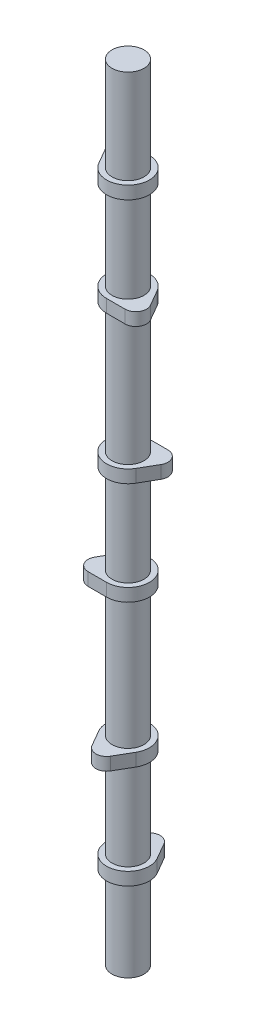
ISO-10303-21;
HEADER;
FILE_DESCRIPTION(('STEP AP214'),'2;1');
FILE_NAME('part.step','',(''),(''),'','','');
FILE_SCHEMA(('AUTOMOTIVE_DESIGN { 1 0 10303 214 1 1 1 1 }'));
ENDSEC;
DATA;
#1=APPLICATION_CONTEXT('core data for automotive mechanical design processes');
#2=APPLICATION_PROTOCOL_DEFINITION('international standard','automotive_design',2000,#1);
#3=PRODUCT_CONTEXT('',#1,'mechanical');
#4=PRODUCT('Part','Part','',(#3));
#5=PRODUCT_RELATED_PRODUCT_CATEGORY('part','',(#4));
#6=PRODUCT_DEFINITION_FORMATION('','',#4);
#7=PRODUCT_DEFINITION_CONTEXT('part definition',#1,'design');
#8=PRODUCT_DEFINITION('design','',#6,#7);
#9=PRODUCT_DEFINITION_SHAPE('','',#8);
#10=(LENGTH_UNIT() NAMED_UNIT(*) SI_UNIT(.MILLI.,.METRE.));
#11=(NAMED_UNIT(*) PLANE_ANGLE_UNIT() SI_UNIT($,.RADIAN.));
#12=(NAMED_UNIT(*) SI_UNIT($,.STERADIAN.) SOLID_ANGLE_UNIT());
#13=UNCERTAINTY_MEASURE_WITH_UNIT(LENGTH_MEASURE(1.E-05),#10,'distance_accuracy_value','');
#14=(GEOMETRIC_REPRESENTATION_CONTEXT(3) GLOBAL_UNCERTAINTY_ASSIGNED_CONTEXT((#13)) GLOBAL_UNIT_ASSIGNED_CONTEXT((#10,
#11,#12)) REPRESENTATION_CONTEXT('',''));
#15=CARTESIAN_POINT('',(0.,0.,0.));
#16=DIRECTION('',(0.,0.,1.));
#17=DIRECTION('',(1.,0.,0.));
#18=AXIS2_PLACEMENT_3D('',#15,#16,#17);
#19=CARTESIAN_POINT('',(0.,64.77,12.7));
#20=DIRECTION('',(0.,-1.,0.));
#21=DIRECTION('',(0.,0.,1.));
#22=AXIS2_PLACEMENT_3D('',#19,#20,#21);
#23=CYLINDRICAL_SURFACE('',#22,6.35);
#24=CARTESIAN_POINT('',(0.,57.15,12.7));
#25=DIRECTION('',(0.,1.,0.));
#26=DIRECTION('',(0.,0.,-1.));
#27=AXIS2_PLACEMENT_3D('',#24,#25,#26);
#28=CIRCLE('',#27,6.35);
#29=CARTESIAN_POINT('',(-5.4992613140313,57.15,15.875));
#30=VERTEX_POINT('',#29);
#31=CARTESIAN_POINT('',(5.49926131403107,57.15,15.875));
#32=VERTEX_POINT('',#31);
#33=EDGE_CURVE('E460',#30,#32,#28,.T.);
#34=ORIENTED_EDGE('',*,*,#33,.T.);
#35=DIRECTION('',(0.,-1.,0.));
#36=VECTOR('',#35,1.);
#37=CARTESIAN_POINT('',(5.49926131403107,64.77,15.875));
#38=LINE('',#37,#36);
#39=CARTESIAN_POINT('',(5.49926131403107,64.77,15.875));
#40=VERTEX_POINT('',#39);
#41=EDGE_CURVE('E490',#40,#32,#38,.T.);
#42=ORIENTED_EDGE('',*,*,#41,.F.);
#43=CARTESIAN_POINT('',(0.,64.77,12.7));
#44=DIRECTION('',(0.,1.,0.));
#45=DIRECTION('',(0.,0.,-1.));
#46=AXIS2_PLACEMENT_3D('',#43,#44,#45);
#47=CIRCLE('',#46,6.35);
#48=CARTESIAN_POINT('',(-5.4992613140313,64.77,15.875));
#49=VERTEX_POINT('',#48);
#50=EDGE_CURVE('E461',#49,#40,#47,.T.);
#51=ORIENTED_EDGE('',*,*,#50,.F.);
#52=DIRECTION('',(0.,-1.,0.));
#53=VECTOR('',#52,1.);
#54=CARTESIAN_POINT('',(-5.4992613140313,64.77,15.875));
#55=LINE('',#54,#53);
#56=EDGE_CURVE('E471',#49,#30,#55,.T.);
#57=ORIENTED_EDGE('',*,*,#56,.T.);
#58=EDGE_LOOP('',(#34,#42,#51,#57));
#59=FACE_BOUND('',#58,.T.);
#60=ADVANCED_FACE('F41',(#59),#23,.T.);
#61=CARTESIAN_POINT('',(5.49926131403107,64.77,15.875));
#62=DIRECTION('',(-0.866025403784435,0.,-0.500000000000006));
#63=DIRECTION('',(-0.500000000000006,0.,0.866025403784435));
#64=AXIS2_PLACEMENT_3D('',#61,#62,#63);
#65=PLANE('',#64);
#66=DIRECTION('',(0.500000000000006,0.,-0.866025403784435));
#67=VECTOR('',#66,1.);
#68=CARTESIAN_POINT('',(5.49926131403107,57.15,15.875));
#69=LINE('',#68,#67);
#70=CARTESIAN_POINT('',(10.9985226280623,57.15,6.35000000000008));
#71=VERTEX_POINT('',#70);
#72=EDGE_CURVE('E475',#32,#71,#69,.T.);
#73=ORIENTED_EDGE('',*,*,#72,.T.);
#74=DIRECTION('',(0.,-1.,0.));
#75=VECTOR('',#74,1.);
#76=CARTESIAN_POINT('',(10.9985226280623,64.77,6.35000000000008));
#77=LINE('',#76,#75);
#78=CARTESIAN_POINT('',(10.9985226280623,64.77,6.35000000000008));
#79=VERTEX_POINT('',#78);
#80=EDGE_CURVE('E487',#79,#71,#77,.T.);
#81=ORIENTED_EDGE('',*,*,#80,.F.);
#82=DIRECTION('',(0.500000000000006,0.,-0.866025403784435));
#83=VECTOR('',#82,1.);
#84=CARTESIAN_POINT('',(5.49926131403107,64.77,15.875));
#85=LINE('',#84,#83);
#86=EDGE_CURVE('E91',#40,#79,#85,.T.);
#87=ORIENTED_EDGE('',*,*,#86,.F.);
#88=ORIENTED_EDGE('',*,*,#41,.T.);
#89=EDGE_LOOP('',(#73,#81,#87,#88));
#90=FACE_BOUND('',#89,.T.);
#91=ADVANCED_FACE('F511',(#90),#65,.F.);
#92=CARTESIAN_POINT('',(0.,64.77,0.));
#93=DIRECTION('',(0.,-1.,0.));
#94=DIRECTION('',(0.,0.,1.));
#95=AXIS2_PLACEMENT_3D('',#92,#93,#94);
#96=CYLINDRICAL_SURFACE('',#95,12.7);
#97=CARTESIAN_POINT('',(0.,57.15,0.));
#98=DIRECTION('',(0.,1.,0.));
#99=DIRECTION('',(0.,0.,-1.));
#100=AXIS2_PLACEMENT_3D('',#97,#98,#99);
#101=CIRCLE('',#100,12.7);
#102=CARTESIAN_POINT('',(-10.9985226280624,57.15,6.34999999999992));
#103=VERTEX_POINT('',#102);
#104=EDGE_CURVE('E77',#71,#103,#101,.T.);
#105=ORIENTED_EDGE('',*,*,#104,.T.);
#106=DIRECTION('',(0.,-1.,0.));
#107=VECTOR('',#106,1.);
#108=CARTESIAN_POINT('',(-10.9985226280624,64.77,6.34999999999992));
#109=LINE('',#108,#107);
#110=CARTESIAN_POINT('',(-10.9985226280624,64.77,6.34999999999992));
#111=VERTEX_POINT('',#110);
#112=EDGE_CURVE('E484',#111,#103,#109,.T.);
#113=ORIENTED_EDGE('',*,*,#112,.F.);
#114=CARTESIAN_POINT('',(0.,64.77,0.));
#115=DIRECTION('',(0.,1.,0.));
#116=DIRECTION('',(0.,0.,-1.));
#117=AXIS2_PLACEMENT_3D('',#114,#115,#116);
#118=CIRCLE('',#117,12.7);
#119=EDGE_CURVE('E466',#79,#111,#118,.T.);
#120=ORIENTED_EDGE('',*,*,#119,.F.);
#121=ORIENTED_EDGE('',*,*,#80,.T.);
#122=EDGE_LOOP('',(#105,#113,#120,#121));
#123=FACE_BOUND('',#122,.T.);
#124=ADVANCED_FACE('F510',(#123),#96,.T.);
#125=CARTESIAN_POINT('',(-5.4992613140313,64.77,15.875));
#126=DIRECTION('',(0.866025403784442,0.,-0.499999999999994));
#127=DIRECTION('',(-0.499999999999994,0.,-0.866025403784442));
#128=AXIS2_PLACEMENT_3D('',#125,#126,#127);
#129=PLANE('',#128);
#130=DIRECTION('',(0.499999999999994,0.,0.866025403784442));
#131=VECTOR('',#130,1.);
#132=CARTESIAN_POINT('',(-5.4992613140313,57.15,15.875));
#133=LINE('',#132,#131);
#134=EDGE_CURVE('E83',#103,#30,#133,.T.);
#135=ORIENTED_EDGE('',*,*,#134,.T.);
#136=ORIENTED_EDGE('',*,*,#56,.F.);
#137=DIRECTION('',(0.499999999999994,0.,0.866025403784442));
#138=VECTOR('',#137,1.);
#139=CARTESIAN_POINT('',(-5.4992613140313,64.77,15.875));
#140=LINE('',#139,#138);
#141=EDGE_CURVE('E59',#111,#49,#140,.T.);
#142=ORIENTED_EDGE('',*,*,#141,.F.);
#143=ORIENTED_EDGE('',*,*,#112,.T.);
#144=EDGE_LOOP('',(#135,#136,#142,#143));
#145=FACE_BOUND('',#144,.T.);
#146=ADVANCED_FACE('F508',(#145),#129,.F.);
#147=CARTESIAN_POINT('',(0.,64.77,12.7));
#148=DIRECTION('',(0.,1.,0.));
#149=DIRECTION('',(0.,0.,-1.));
#150=AXIS2_PLACEMENT_3D('',#147,#148,#149);
#151=PLANE('',#150);
#152=CARTESIAN_POINT('',(0.,64.77,0.));
#153=DIRECTION('',(0.,1.,0.));
#154=DIRECTION('',(0.,0.,1.));
#155=AXIS2_PLACEMENT_3D('',#152,#153,#154);
#156=CIRCLE('',#155,9.5);
#157=CARTESIAN_POINT('',(0.,64.77,9.5));
#158=VERTEX_POINT('',#157);
#159=EDGE_CURVE('E456',#158,#158,#156,.F.);
#160=ORIENTED_EDGE('',*,*,#159,.T.);
#161=EDGE_LOOP('',(#160));
#162=FACE_BOUND('',#161,.T.);
#163=ORIENTED_EDGE('',*,*,#50,.T.);
#164=ORIENTED_EDGE('',*,*,#86,.T.);
#165=ORIENTED_EDGE('',*,*,#119,.T.);
#166=ORIENTED_EDGE('',*,*,#141,.T.);
#167=EDGE_LOOP('',(#163,#164,#165,#166));
#168=FACE_BOUND('',#167,.T.);
#169=ADVANCED_FACE('F502',(#162,#168),#151,.T.);
#170=CARTESIAN_POINT('',(0.,57.15,12.7));
#171=DIRECTION('',(0.,1.,0.));
#172=DIRECTION('',(0.,0.,-1.));
#173=AXIS2_PLACEMENT_3D('',#170,#171,#172);
#174=PLANE('',#173);
#175=CARTESIAN_POINT('',(0.,57.15,0.));
#176=DIRECTION('',(0.,1.,0.));
#177=DIRECTION('',(0.,0.,1.));
#178=AXIS2_PLACEMENT_3D('',#175,#176,#177);
#179=CIRCLE('',#178,9.5);
#180=CARTESIAN_POINT('',(0.,57.15,9.5));
#181=VERTEX_POINT('',#180);
#182=EDGE_CURVE('E51',#181,#181,#179,.F.);
#183=ORIENTED_EDGE('',*,*,#182,.F.);
#184=EDGE_LOOP('',(#183));
#185=FACE_BOUND('',#184,.T.);
#186=ORIENTED_EDGE('',*,*,#33,.F.);
#187=ORIENTED_EDGE('',*,*,#134,.F.);
#188=ORIENTED_EDGE('',*,*,#104,.F.);
#189=ORIENTED_EDGE('',*,*,#72,.F.);
#190=EDGE_LOOP('',(#186,#187,#188,#189));
#191=FACE_BOUND('',#190,.T.);
#192=ADVANCED_FACE('F499',(#185,#191),#174,.F.);
#193=CARTESIAN_POINT('',(0.,120.65,0.));
#194=DIRECTION('',(0.,-1.,0.));
#195=DIRECTION('',(0.,0.,-1.));
#196=AXIS2_PLACEMENT_3D('',#193,#194,#195);
#197=CYLINDRICAL_SURFACE('',#196,9.5);
#198=CARTESIAN_POINT('',(0.,3.80999999999999,0.));
#199=DIRECTION('',(0.,1.,0.));
#200=DIRECTION('',(0.,0.,1.));
#201=AXIS2_PLACEMENT_3D('',#198,#199,#200);
#202=CIRCLE('',#201,9.5);
#203=CARTESIAN_POINT('',(0.,3.80999999999999,9.5));
#204=VERTEX_POINT('',#203);
#205=EDGE_CURVE('E44',#204,#204,#202,.T.);
#206=ORIENTED_EDGE('',*,*,#205,.T.);
#207=EDGE_LOOP('',(#206));
#208=FACE_BOUND('',#207,.T.);
#209=ORIENTED_EDGE('',*,*,#182,.T.);
#210=EDGE_LOOP('',(#209));
#211=FACE_BOUND('',#210,.T.);
#212=ADVANCED_FACE('F497',(#208,#211),#197,.T.);
#213=ORIENTED_EDGE('',*,*,#159,.F.);
#214=EDGE_LOOP('',(#213));
#215=FACE_BOUND('',#214,.T.);
#216=CARTESIAN_POINT('',(0.,142.24,0.));
#217=DIRECTION('',(0.,1.,0.));
#218=DIRECTION('',(0.866025403784436,0.,-0.500000000000004));
#219=AXIS2_PLACEMENT_3D('',#216,#217,#218);
#220=CIRCLE('',#219,9.5);
#221=CARTESIAN_POINT('',(8.22724133595215,142.24,-4.75000000000004));
#222=VERTEX_POINT('',#221);
#223=EDGE_CURVE('E403',#222,#222,#220,.T.);
#224=ORIENTED_EDGE('',*,*,#223,.F.);
#225=EDGE_LOOP('',(#224));
#226=FACE_BOUND('',#225,.T.);
#227=ADVANCED_FACE('F524',(#215,#226),#197,.T.);
#228=CARTESIAN_POINT('',(0.,3.81,-12.7));
#229=DIRECTION('',(0.,-1.,0.));
#230=DIRECTION('',(0.,0.,-1.));
#231=AXIS2_PLACEMENT_3D('',#228,#229,#230);
#232=CYLINDRICAL_SURFACE('',#231,6.35);
#233=CARTESIAN_POINT('',(0.,-3.81,-12.7));
#234=DIRECTION('',(0.,1.,0.));
#235=DIRECTION('',(0.,0.,1.));
#236=AXIS2_PLACEMENT_3D('',#233,#234,#235);
#237=CIRCLE('',#236,6.35);
#238=CARTESIAN_POINT('',(5.49926131403118,-3.81,-15.875));
#239=VERTEX_POINT('',#238);
#240=CARTESIAN_POINT('',(-5.49926131403118,-3.81,-15.875));
#241=VERTEX_POINT('',#240);
#242=EDGE_CURVE('E414',#239,#241,#237,.T.);
#243=ORIENTED_EDGE('',*,*,#242,.T.);
#244=DIRECTION('',(0.,-1.,0.));
#245=VECTOR('',#244,1.);
#246=CARTESIAN_POINT('',(-5.49926131403118,3.81,-15.875));
#247=LINE('',#246,#245);
#248=CARTESIAN_POINT('',(-5.49926131403118,3.81,-15.875));
#249=VERTEX_POINT('',#248);
#250=EDGE_CURVE('E452',#249,#241,#247,.T.);
#251=ORIENTED_EDGE('',*,*,#250,.F.);
#252=CARTESIAN_POINT('',(0.,3.81,-12.7));
#253=DIRECTION('',(0.,1.,0.));
#254=DIRECTION('',(0.,0.,1.));
#255=AXIS2_PLACEMENT_3D('',#252,#253,#254);
#256=CIRCLE('',#255,6.35);
#257=CARTESIAN_POINT('',(5.49926131403118,3.81,-15.875));
#258=VERTEX_POINT('',#257);
#259=EDGE_CURVE('E415',#258,#249,#256,.T.);
#260=ORIENTED_EDGE('',*,*,#259,.F.);
#261=DIRECTION('',(0.,-1.,0.));
#262=VECTOR('',#261,1.);
#263=CARTESIAN_POINT('',(5.49926131403118,3.81,-15.875));
#264=LINE('',#263,#262);
#265=EDGE_CURVE('E429',#258,#239,#264,.T.);
#266=ORIENTED_EDGE('',*,*,#265,.T.);
#267=EDGE_LOOP('',(#243,#251,#260,#266));
#268=FACE_BOUND('',#267,.T.);
#269=ADVANCED_FACE('F527',(#268),#232,.T.);
#270=CARTESIAN_POINT('',(-5.49926131403118,3.81,-15.875));
#271=DIRECTION('',(0.866025403784438,0.,0.5));
#272=DIRECTION('',(0.5,0.,-0.866025403784439));
#273=AXIS2_PLACEMENT_3D('',#270,#271,#272);
#274=PLANE('',#273);
#275=DIRECTION('',(-0.5,0.,0.866025403784439));
#276=VECTOR('',#275,1.);
#277=CARTESIAN_POINT('',(-5.49926131403118,-3.81,-15.875));
#278=LINE('',#277,#276);
#279=CARTESIAN_POINT('',(-10.9985226280624,-3.81,-6.35000000000001));
#280=VERTEX_POINT('',#279);
#281=EDGE_CURVE('E433',#241,#280,#278,.T.);
#282=ORIENTED_EDGE('',*,*,#281,.T.);
#283=DIRECTION('',(0.,-1.,0.));
#284=VECTOR('',#283,1.);
#285=CARTESIAN_POINT('',(-10.9985226280624,3.81,-6.35000000000001));
#286=LINE('',#285,#284);
#287=CARTESIAN_POINT('',(-10.9985226280624,3.81,-6.35000000000001));
#288=VERTEX_POINT('',#287);
#289=EDGE_CURVE('E448',#288,#280,#286,.T.);
#290=ORIENTED_EDGE('',*,*,#289,.F.);
#291=DIRECTION('',(-0.5,0.,0.866025403784439));
#292=VECTOR('',#291,1.);
#293=CARTESIAN_POINT('',(-5.49926131403118,3.81,-15.875));
#294=LINE('',#293,#292);
#295=EDGE_CURVE('E419',#249,#288,#294,.T.);
#296=ORIENTED_EDGE('',*,*,#295,.F.);
#297=ORIENTED_EDGE('',*,*,#250,.T.);
#298=EDGE_LOOP('',(#282,#290,#296,#297));
#299=FACE_BOUND('',#298,.T.);
#300=ADVANCED_FACE('F532',(#299),#274,.F.);
#301=CARTESIAN_POINT('',(0.,3.81,0.));
#302=DIRECTION('',(0.,-1.,0.));
#303=DIRECTION('',(0.,0.,-1.));
#304=AXIS2_PLACEMENT_3D('',#301,#302,#303);
#305=CYLINDRICAL_SURFACE('',#304,12.7);
#306=CARTESIAN_POINT('',(0.,-3.81,0.));
#307=DIRECTION('',(0.,1.,0.));
#308=DIRECTION('',(0.,0.,1.));
#309=AXIS2_PLACEMENT_3D('',#306,#307,#308);
#310=CIRCLE('',#309,12.7);
#311=CARTESIAN_POINT('',(10.9985226280624,-3.81,-6.35));
#312=VERTEX_POINT('',#311);
#313=EDGE_CURVE('E436',#280,#312,#310,.T.);
#314=ORIENTED_EDGE('',*,*,#313,.T.);
#315=DIRECTION('',(0.,-1.,0.));
#316=VECTOR('',#315,1.);
#317=CARTESIAN_POINT('',(10.9985226280624,3.81,-6.35));
#318=LINE('',#317,#316);
#319=CARTESIAN_POINT('',(10.9985226280624,3.81,-6.35));
#320=VERTEX_POINT('',#319);
#321=EDGE_CURVE('E444',#320,#312,#318,.T.);
#322=ORIENTED_EDGE('',*,*,#321,.F.);
#323=CARTESIAN_POINT('',(0.,3.81,0.));
#324=DIRECTION('',(0.,1.,0.));
#325=DIRECTION('',(0.,0.,1.));
#326=AXIS2_PLACEMENT_3D('',#323,#324,#325);
#327=CIRCLE('',#326,12.7);
#328=EDGE_CURVE('E423',#288,#320,#327,.T.);
#329=ORIENTED_EDGE('',*,*,#328,.F.);
#330=ORIENTED_EDGE('',*,*,#289,.T.);
#331=EDGE_LOOP('',(#314,#322,#329,#330));
#332=FACE_BOUND('',#331,.T.);
#333=ADVANCED_FACE('F536',(#332),#305,.T.);
#334=CARTESIAN_POINT('',(5.49926131403118,3.81,-15.875));
#335=DIRECTION('',(-0.866025403784439,0.,0.5));
#336=DIRECTION('',(0.5,0.,0.866025403784439));
#337=AXIS2_PLACEMENT_3D('',#334,#335,#336);
#338=PLANE('',#337);
#339=DIRECTION('',(-0.5,0.,-0.866025403784439));
#340=VECTOR('',#339,1.);
#341=CARTESIAN_POINT('',(5.49926131403118,-3.81,-15.875));
#342=LINE('',#341,#340);
#343=EDGE_CURVE('E420',#312,#239,#342,.T.);
#344=ORIENTED_EDGE('',*,*,#343,.T.);
#345=ORIENTED_EDGE('',*,*,#265,.F.);
#346=DIRECTION('',(-0.5,0.,-0.866025403784439));
#347=VECTOR('',#346,1.);
#348=CARTESIAN_POINT('',(5.49926131403118,3.81,-15.875));
#349=LINE('',#348,#347);
#350=EDGE_CURVE('E426',#320,#258,#349,.T.);
#351=ORIENTED_EDGE('',*,*,#350,.F.);
#352=ORIENTED_EDGE('',*,*,#321,.T.);
#353=EDGE_LOOP('',(#344,#345,#351,#352));
#354=FACE_BOUND('',#353,.T.);
#355=ADVANCED_FACE('F540',(#354),#338,.F.);
#356=CARTESIAN_POINT('',(0.,3.81,-12.7));
#357=DIRECTION('',(0.,1.,0.));
#358=DIRECTION('',(0.,0.,1.));
#359=AXIS2_PLACEMENT_3D('',#356,#357,#358);
#360=PLANE('',#359);
#361=ORIENTED_EDGE('',*,*,#205,.F.);
#362=EDGE_LOOP('',(#361));
#363=FACE_BOUND('',#362,.T.);
#364=ORIENTED_EDGE('',*,*,#259,.T.);
#365=ORIENTED_EDGE('',*,*,#295,.T.);
#366=ORIENTED_EDGE('',*,*,#328,.T.);
#367=ORIENTED_EDGE('',*,*,#350,.T.);
#368=EDGE_LOOP('',(#364,#365,#366,#367));
#369=FACE_BOUND('',#368,.T.);
#370=ADVANCED_FACE('F544',(#363,#369),#360,.T.);
#371=CARTESIAN_POINT('',(0.,-3.81,-12.7));
#372=DIRECTION('',(0.,1.,0.));
#373=DIRECTION('',(0.,0.,1.));
#374=AXIS2_PLACEMENT_3D('',#371,#372,#373);
#375=PLANE('',#374);
#376=CARTESIAN_POINT('',(0.,-3.80999999999999,0.));
#377=DIRECTION('',(0.,1.,0.));
#378=DIRECTION('',(0.,0.,1.));
#379=AXIS2_PLACEMENT_3D('',#376,#377,#378);
#380=CIRCLE('',#379,9.5);
#381=CARTESIAN_POINT('',(0.,-3.80999999999999,9.5));
#382=VERTEX_POINT('',#381);
#383=EDGE_CURVE('E11',#382,#382,#380,.T.);
#384=ORIENTED_EDGE('',*,*,#383,.T.);
#385=EDGE_LOOP('',(#384));
#386=FACE_BOUND('',#385,.T.);
#387=ORIENTED_EDGE('',*,*,#242,.F.);
#388=ORIENTED_EDGE('',*,*,#343,.F.);
#389=ORIENTED_EDGE('',*,*,#313,.F.);
#390=ORIENTED_EDGE('',*,*,#281,.F.);
#391=EDGE_LOOP('',(#387,#388,#389,#390));
#392=FACE_BOUND('',#391,.T.);
#393=ADVANCED_FACE('F546',(#386,#392),#375,.F.);
#394=ORIENTED_EDGE('',*,*,#383,.F.);
#395=EDGE_LOOP('',(#394));
#396=FACE_BOUND('',#395,.T.);
#397=CARTESIAN_POINT('',(0.,-53.34,0.));
#398=DIRECTION('',(0.,-1.,0.));
#399=DIRECTION('',(0.,0.,-1.));
#400=AXIS2_PLACEMENT_3D('',#397,#398,#399);
#401=CIRCLE('',#400,9.5);
#402=CARTESIAN_POINT('',(0.,-53.34,-9.5));
#403=VERTEX_POINT('',#402);
#404=EDGE_CURVE('E407',#403,#403,#401,.T.);
#405=ORIENTED_EDGE('',*,*,#404,.F.);
#406=EDGE_LOOP('',(#405));
#407=FACE_BOUND('',#406,.T.);
#408=ADVANCED_FACE('F529',(#396,#407),#197,.T.);
#409=CARTESIAN_POINT('',(0.,-53.34,0.));
#410=DIRECTION('',(0.,-1.,0.));
#411=DIRECTION('',(0.,0.,-1.));
#412=AXIS2_PLACEMENT_3D('',#409,#410,#411);
#413=PLANE('',#412);
#414=ORIENTED_EDGE('',*,*,#404,.T.);
#415=EDGE_LOOP('',(#414));
#416=FACE_BOUND('',#415,.T.);
#417=ADVANCED_FACE('F553',(#416),#413,.T.);
#418=CARTESIAN_POINT('',(10.9985226280624,210.82,-6.34999999999997));
#419=DIRECTION('',(0.,-1.,0.));
#420=DIRECTION('',(0.86602540378444,0.,-0.499999999999998));
#421=AXIS2_PLACEMENT_3D('',#418,#419,#420);
#422=CYLINDRICAL_SURFACE('',#421,6.35);
#423=CARTESIAN_POINT('',(10.9985226280624,203.2,-6.34999999999997));
#424=DIRECTION('',(0.,1.,0.));
#425=DIRECTION('',(-0.86602540378444,0.,0.499999999999998));
#426=AXIS2_PLACEMENT_3D('',#423,#424,#425);
#427=CIRCLE('',#426,6.35);
#428=CARTESIAN_POINT('',(16.4977839420936,203.2,-3.17499999999996));
#429=VERTEX_POINT('',#428);
#430=CARTESIAN_POINT('',(10.9985226280624,203.2,-12.7));
#431=VERTEX_POINT('',#430);
#432=EDGE_CURVE('E357',#429,#431,#427,.T.);
#433=ORIENTED_EDGE('',*,*,#432,.T.);
#434=DIRECTION('',(0.,-1.,0.));
#435=VECTOR('',#434,1.);
#436=CARTESIAN_POINT('',(10.9985226280624,210.82,-12.7));
#437=LINE('',#436,#435);
#438=CARTESIAN_POINT('',(10.9985226280624,210.82,-12.7));
#439=VERTEX_POINT('',#438);
#440=EDGE_CURVE('E395',#439,#431,#437,.T.);
#441=ORIENTED_EDGE('',*,*,#440,.F.);
#442=CARTESIAN_POINT('',(10.9985226280624,210.82,-6.34999999999997));
#443=DIRECTION('',(0.,1.,0.));
#444=DIRECTION('',(-0.86602540378444,0.,0.499999999999998));
#445=AXIS2_PLACEMENT_3D('',#442,#443,#444);
#446=CIRCLE('',#445,6.35);
#447=CARTESIAN_POINT('',(16.4977839420936,210.82,-3.17499999999996));
#448=VERTEX_POINT('',#447);
#449=EDGE_CURVE('E358',#448,#439,#446,.T.);
#450=ORIENTED_EDGE('',*,*,#449,.F.);
#451=DIRECTION('',(0.,-1.,0.));
#452=VECTOR('',#451,1.);
#453=CARTESIAN_POINT('',(16.4977839420936,210.82,-3.17499999999996));
#454=LINE('',#453,#452);
#455=EDGE_CURVE('E372',#448,#429,#454,.T.);
#456=ORIENTED_EDGE('',*,*,#455,.T.);
#457=EDGE_LOOP('',(#433,#441,#450,#456));
#458=FACE_BOUND('',#457,.T.);
#459=ADVANCED_FACE('F556',(#458),#422,.T.);
#460=CARTESIAN_POINT('',(10.9985226280624,210.82,-12.7));
#461=DIRECTION('',(0.,0.,1.));
#462=DIRECTION('',(1.,0.,0.));
#463=AXIS2_PLACEMENT_3D('',#460,#461,#462);
#464=PLANE('',#463);
#465=DIRECTION('',(-1.,0.,0.));
#466=VECTOR('',#465,1.);
#467=CARTESIAN_POINT('',(10.9985226280624,203.2,-12.7));
#468=LINE('',#467,#466);
#469=CARTESIAN_POINT('',(0.,203.2,-12.7));
#470=VERTEX_POINT('',#469);
#471=EDGE_CURVE('E376',#431,#470,#468,.T.);
#472=ORIENTED_EDGE('',*,*,#471,.T.);
#473=DIRECTION('',(0.,-1.,0.));
#474=VECTOR('',#473,1.);
#475=CARTESIAN_POINT('',(0.,210.82,-12.7));
#476=LINE('',#475,#474);
#477=CARTESIAN_POINT('',(0.,210.82,-12.7));
#478=VERTEX_POINT('',#477);
#479=EDGE_CURVE('E391',#478,#470,#476,.T.);
#480=ORIENTED_EDGE('',*,*,#479,.F.);
#481=DIRECTION('',(-1.,0.,0.));
#482=VECTOR('',#481,1.);
#483=CARTESIAN_POINT('',(10.9985226280624,210.82,-12.7));
#484=LINE('',#483,#482);
#485=EDGE_CURVE('E362',#439,#478,#484,.T.);
#486=ORIENTED_EDGE('',*,*,#485,.F.);
#487=ORIENTED_EDGE('',*,*,#440,.T.);
#488=EDGE_LOOP('',(#472,#480,#486,#487));
#489=FACE_BOUND('',#488,.T.);
#490=ADVANCED_FACE('F560',(#489),#464,.F.);
#491=CARTESIAN_POINT('',(0.,210.82,0.));
#492=DIRECTION('',(0.,-1.,0.));
#493=DIRECTION('',(0.86602540378444,0.,-0.499999999999998));
#494=AXIS2_PLACEMENT_3D('',#491,#492,#493);
#495=CYLINDRICAL_SURFACE('',#494,12.7);
#496=CARTESIAN_POINT('',(0.,203.2,0.));
#497=DIRECTION('',(0.,1.,0.));
#498=DIRECTION('',(-0.86602540378444,0.,0.499999999999998));
#499=AXIS2_PLACEMENT_3D('',#496,#497,#498);
#500=CIRCLE('',#499,12.7);
#501=CARTESIAN_POINT('',(10.9985226280624,203.2,6.35000000000003));
#502=VERTEX_POINT('',#501);
#503=EDGE_CURVE('E379',#470,#502,#500,.T.);
#504=ORIENTED_EDGE('',*,*,#503,.T.);
#505=DIRECTION('',(0.,-1.,0.));
#506=VECTOR('',#505,1.);
#507=CARTESIAN_POINT('',(10.9985226280624,210.82,6.35000000000003));
#508=LINE('',#507,#506);
#509=CARTESIAN_POINT('',(10.9985226280624,210.82,6.35000000000003));
#510=VERTEX_POINT('',#509);
#511=EDGE_CURVE('E387',#510,#502,#508,.T.);
#512=ORIENTED_EDGE('',*,*,#511,.F.);
#513=CARTESIAN_POINT('',(0.,210.82,0.));
#514=DIRECTION('',(0.,1.,0.));
#515=DIRECTION('',(-0.86602540378444,0.,0.499999999999998));
#516=AXIS2_PLACEMENT_3D('',#513,#514,#515);
#517=CIRCLE('',#516,12.7);
#518=EDGE_CURVE('E366',#478,#510,#517,.T.);
#519=ORIENTED_EDGE('',*,*,#518,.F.);
#520=ORIENTED_EDGE('',*,*,#479,.T.);
#521=EDGE_LOOP('',(#504,#512,#519,#520));
#522=FACE_BOUND('',#521,.T.);
#523=ADVANCED_FACE('F564',(#522),#495,.T.);
#524=CARTESIAN_POINT('',(16.4977839420936,210.82,-3.17499999999996));
#525=DIRECTION('',(-0.866025403784437,0.,-0.500000000000002));
#526=DIRECTION('',(-0.500000000000002,0.,0.866025403784437));
#527=AXIS2_PLACEMENT_3D('',#524,#525,#526);
#528=PLANE('',#527);
#529=DIRECTION('',(0.500000000000002,0.,-0.866025403784437));
#530=VECTOR('',#529,1.);
#531=CARTESIAN_POINT('',(16.4977839420936,203.2,-3.17499999999996));
#532=LINE('',#531,#530);
#533=EDGE_CURVE('E363',#502,#429,#532,.T.);
#534=ORIENTED_EDGE('',*,*,#533,.T.);
#535=ORIENTED_EDGE('',*,*,#455,.F.);
#536=DIRECTION('',(0.500000000000002,0.,-0.866025403784437));
#537=VECTOR('',#536,1.);
#538=CARTESIAN_POINT('',(16.4977839420936,210.82,-3.17499999999996));
#539=LINE('',#538,#537);
#540=EDGE_CURVE('E369',#510,#448,#539,.T.);
#541=ORIENTED_EDGE('',*,*,#540,.F.);
#542=ORIENTED_EDGE('',*,*,#511,.T.);
#543=EDGE_LOOP('',(#534,#535,#541,#542));
#544=FACE_BOUND('',#543,.T.);
#545=ADVANCED_FACE('F568',(#544),#528,.F.);
#546=CARTESIAN_POINT('',(10.9985226280624,210.82,-6.34999999999997));
#547=DIRECTION('',(0.,1.,0.));
#548=DIRECTION('',(-0.86602540378444,0.,0.499999999999998));
#549=AXIS2_PLACEMENT_3D('',#546,#547,#548);
#550=PLANE('',#549);
#551=CARTESIAN_POINT('',(0.,210.82,0.));
#552=DIRECTION('',(0.,1.,0.));
#553=DIRECTION('',(0.866025403784436,0.,-0.500000000000004));
#554=AXIS2_PLACEMENT_3D('',#551,#552,#553);
#555=CIRCLE('',#554,9.5);
#556=CARTESIAN_POINT('',(8.22724133595215,210.82,-4.75000000000004));
#557=VERTEX_POINT('',#556);
#558=EDGE_CURVE('E353',#557,#557,#555,.F.);
#559=ORIENTED_EDGE('',*,*,#558,.T.);
#560=EDGE_LOOP('',(#559));
#561=FACE_BOUND('',#560,.T.);
#562=ORIENTED_EDGE('',*,*,#449,.T.);
#563=ORIENTED_EDGE('',*,*,#485,.T.);
#564=ORIENTED_EDGE('',*,*,#518,.T.);
#565=ORIENTED_EDGE('',*,*,#540,.T.);
#566=EDGE_LOOP('',(#562,#563,#564,#565));
#567=FACE_BOUND('',#566,.T.);
#568=ADVANCED_FACE('F572',(#561,#567),#550,.T.);
#569=CARTESIAN_POINT('',(10.9985226280624,203.2,-6.34999999999997));
#570=DIRECTION('',(0.,1.,0.));
#571=DIRECTION('',(-0.86602540378444,0.,0.499999999999998));
#572=AXIS2_PLACEMENT_3D('',#569,#570,#571);
#573=PLANE('',#572);
#574=CARTESIAN_POINT('',(0.,203.2,0.));
#575=DIRECTION('',(0.,1.,0.));
#576=DIRECTION('',(0.866025403784436,0.,-0.500000000000004));
#577=AXIS2_PLACEMENT_3D('',#574,#575,#576);
#578=CIRCLE('',#577,9.5);
#579=CARTESIAN_POINT('',(8.22724133595215,203.2,-4.75000000000004));
#580=VERTEX_POINT('',#579);
#581=EDGE_CURVE('E399',#580,#580,#578,.F.);
#582=ORIENTED_EDGE('',*,*,#581,.F.);
#583=EDGE_LOOP('',(#582));
#584=FACE_BOUND('',#583,.T.);
#585=ORIENTED_EDGE('',*,*,#432,.F.);
#586=ORIENTED_EDGE('',*,*,#533,.F.);
#587=ORIENTED_EDGE('',*,*,#503,.F.);
#588=ORIENTED_EDGE('',*,*,#471,.F.);
#589=EDGE_LOOP('',(#585,#586,#587,#588));
#590=FACE_BOUND('',#589,.T.);
#591=ADVANCED_FACE('F574',(#584,#590),#573,.F.);
#592=CARTESIAN_POINT('',(0.,266.7,0.));
#593=DIRECTION('',(0.,-1.,0.));
#594=DIRECTION('',(-0.866025403784436,0.,0.500000000000004));
#595=AXIS2_PLACEMENT_3D('',#592,#593,#594);
#596=CYLINDRICAL_SURFACE('',#595,9.5);
#597=CARTESIAN_POINT('',(0.,149.86,0.));
#598=DIRECTION('',(0.,1.,0.));
#599=DIRECTION('',(0.866025403784436,0.,-0.500000000000004));
#600=AXIS2_PLACEMENT_3D('',#597,#598,#599);
#601=CIRCLE('',#600,9.5);
#602=CARTESIAN_POINT('',(8.22724133595215,149.86,-4.75000000000004));
#603=VERTEX_POINT('',#602);
#604=EDGE_CURVE('E352',#603,#603,#601,.T.);
#605=ORIENTED_EDGE('',*,*,#604,.T.);
#606=EDGE_LOOP('',(#605));
#607=FACE_BOUND('',#606,.T.);
#608=ORIENTED_EDGE('',*,*,#581,.T.);
#609=EDGE_LOOP('',(#608));
#610=FACE_BOUND('',#609,.T.);
#611=ADVANCED_FACE('F577',(#607,#610),#596,.T.);
#612=ORIENTED_EDGE('',*,*,#558,.F.);
#613=EDGE_LOOP('',(#612));
#614=FACE_BOUND('',#613,.T.);
#615=CARTESIAN_POINT('',(0.,288.29,0.));
#616=DIRECTION('',(0.,1.,0.));
#617=DIRECTION('',(-0.866025403784443,0.,-0.499999999999992));
#618=AXIS2_PLACEMENT_3D('',#615,#616,#617);
#619=CIRCLE('',#618,9.5);
#620=CARTESIAN_POINT('',(-8.22724133595221,288.29,-4.74999999999992));
#621=VERTEX_POINT('',#620);
#622=EDGE_CURVE('E306',#621,#621,#619,.T.);
#623=ORIENTED_EDGE('',*,*,#622,.F.);
#624=EDGE_LOOP('',(#623));
#625=FACE_BOUND('',#624,.T.);
#626=ADVANCED_FACE('F582',(#614,#625),#596,.T.);
#627=CARTESIAN_POINT('',(-10.9985226280623,149.86,6.35000000000005));
#628=DIRECTION('',(0.,-1.,0.));
#629=DIRECTION('',(-0.866025403784436,0.,0.500000000000004));
#630=AXIS2_PLACEMENT_3D('',#627,#628,#629);
#631=CYLINDRICAL_SURFACE('',#630,6.35);
#632=CARTESIAN_POINT('',(-10.9985226280623,142.24,6.35000000000005));
#633=DIRECTION('',(0.,1.,0.));
#634=DIRECTION('',(0.866025403784436,0.,-0.500000000000004));
#635=AXIS2_PLACEMENT_3D('',#632,#633,#634);
#636=CIRCLE('',#635,6.35);
#637=CARTESIAN_POINT('',(-16.4977839420935,142.24,3.17500000000008));
#638=VERTEX_POINT('',#637);
#639=CARTESIAN_POINT('',(-10.9985226280623,142.24,12.7000000000001));
#640=VERTEX_POINT('',#639);
#641=EDGE_CURVE('E309',#638,#640,#636,.T.);
#642=ORIENTED_EDGE('',*,*,#641,.T.);
#643=DIRECTION('',(0.,-1.,0.));
#644=VECTOR('',#643,1.);
#645=CARTESIAN_POINT('',(-10.9985226280623,149.86,12.7000000000001));
#646=LINE('',#645,#644);
#647=CARTESIAN_POINT('',(-10.9985226280623,149.86,12.7000000000001));
#648=VERTEX_POINT('',#647);
#649=EDGE_CURVE('E348',#648,#640,#646,.T.);
#650=ORIENTED_EDGE('',*,*,#649,.F.);
#651=CARTESIAN_POINT('',(-10.9985226280623,149.86,6.35000000000005));
#652=DIRECTION('',(0.,1.,0.));
#653=DIRECTION('',(0.866025403784436,0.,-0.500000000000004));
#654=AXIS2_PLACEMENT_3D('',#651,#652,#653);
#655=CIRCLE('',#654,6.35);
#656=CARTESIAN_POINT('',(-16.4977839420935,149.86,3.17500000000008));
#657=VERTEX_POINT('',#656);
#658=EDGE_CURVE('E311',#657,#648,#655,.T.);
#659=ORIENTED_EDGE('',*,*,#658,.F.);
#660=DIRECTION('',(0.,-1.,0.));
#661=VECTOR('',#660,1.);
#662=CARTESIAN_POINT('',(-16.4977839420935,149.86,3.17500000000008));
#663=LINE('',#662,#661);
#664=EDGE_CURVE('E325',#657,#638,#663,.T.);
#665=ORIENTED_EDGE('',*,*,#664,.T.);
#666=EDGE_LOOP('',(#642,#650,#659,#665));
#667=FACE_BOUND('',#666,.T.);
#668=ADVANCED_FACE('F585',(#667),#631,.T.);
#669=CARTESIAN_POINT('',(-10.9985226280623,149.86,12.7000000000001));
#670=DIRECTION('',(0.,0.,-1.));
#671=DIRECTION('',(-1.,0.,0.));
#672=AXIS2_PLACEMENT_3D('',#669,#670,#671);
#673=PLANE('',#672);
#674=DIRECTION('',(1.,0.,0.));
#675=VECTOR('',#674,1.);
#676=CARTESIAN_POINT('',(-10.9985226280623,142.24,12.7000000000001));
#677=LINE('',#676,#675);
#678=CARTESIAN_POINT('',(0.,142.24,12.7));
#679=VERTEX_POINT('',#678);
#680=EDGE_CURVE('E329',#640,#679,#677,.T.);
#681=ORIENTED_EDGE('',*,*,#680,.T.);
#682=DIRECTION('',(0.,-1.,0.));
#683=VECTOR('',#682,1.);
#684=CARTESIAN_POINT('',(0.,149.86,12.7));
#685=LINE('',#684,#683);
#686=CARTESIAN_POINT('',(0.,149.86,12.7));
#687=VERTEX_POINT('',#686);
#688=EDGE_CURVE('E344',#687,#679,#685,.T.);
#689=ORIENTED_EDGE('',*,*,#688,.F.);
#690=DIRECTION('',(1.,0.,0.));
#691=VECTOR('',#690,1.);
#692=CARTESIAN_POINT('',(-10.9985226280623,149.86,12.7000000000001));
#693=LINE('',#692,#691);
#694=EDGE_CURVE('E315',#648,#687,#693,.T.);
#695=ORIENTED_EDGE('',*,*,#694,.F.);
#696=ORIENTED_EDGE('',*,*,#649,.T.);
#697=EDGE_LOOP('',(#681,#689,#695,#696));
#698=FACE_BOUND('',#697,.T.);
#699=ADVANCED_FACE('F589',(#698),#673,.F.);
#700=CARTESIAN_POINT('',(0.,149.86,0.));
#701=DIRECTION('',(0.,-1.,0.));
#702=DIRECTION('',(-0.866025403784436,0.,0.500000000000004));
#703=AXIS2_PLACEMENT_3D('',#700,#701,#702);
#704=CYLINDRICAL_SURFACE('',#703,12.7);
#705=CARTESIAN_POINT('',(0.,142.24,0.));
#706=DIRECTION('',(0.,1.,0.));
#707=DIRECTION('',(0.866025403784436,0.,-0.500000000000004));
#708=AXIS2_PLACEMENT_3D('',#705,#706,#707);
#709=CIRCLE('',#708,12.7);
#710=CARTESIAN_POINT('',(-10.9985226280624,142.24,-6.34999999999995));
#711=VERTEX_POINT('',#710);
#712=EDGE_CURVE('E332',#679,#711,#709,.T.);
#713=ORIENTED_EDGE('',*,*,#712,.T.);
#714=DIRECTION('',(0.,-1.,0.));
#715=VECTOR('',#714,1.);
#716=CARTESIAN_POINT('',(-10.9985226280624,149.86,-6.34999999999995));
#717=LINE('',#716,#715);
#718=CARTESIAN_POINT('',(-10.9985226280624,149.86,-6.34999999999995));
#719=VERTEX_POINT('',#718);
#720=EDGE_CURVE('E340',#719,#711,#717,.T.);
#721=ORIENTED_EDGE('',*,*,#720,.F.);
#722=CARTESIAN_POINT('',(0.,149.86,0.));
#723=DIRECTION('',(0.,1.,0.));
#724=DIRECTION('',(0.866025403784436,0.,-0.500000000000004));
#725=AXIS2_PLACEMENT_3D('',#722,#723,#724);
#726=CIRCLE('',#725,12.7);
#727=EDGE_CURVE('E319',#687,#719,#726,.T.);
#728=ORIENTED_EDGE('',*,*,#727,.F.);
#729=ORIENTED_EDGE('',*,*,#688,.T.);
#730=EDGE_LOOP('',(#713,#721,#728,#729));
#731=FACE_BOUND('',#730,.T.);
#732=ADVANCED_FACE('F593',(#731),#704,.T.);
#733=CARTESIAN_POINT('',(-16.4977839420935,149.86,3.17500000000008));
#734=DIRECTION('',(0.866025403784441,0.,0.499999999999996));
#735=DIRECTION('',(0.499999999999996,0.,-0.866025403784441));
#736=AXIS2_PLACEMENT_3D('',#733,#734,#735);
#737=PLANE('',#736);
#738=DIRECTION('',(-0.499999999999996,0.,0.866025403784441));
#739=VECTOR('',#738,1.);
#740=CARTESIAN_POINT('',(-16.4977839420935,142.24,3.17500000000008));
#741=LINE('',#740,#739);
#742=EDGE_CURVE('E316',#711,#638,#741,.T.);
#743=ORIENTED_EDGE('',*,*,#742,.T.);
#744=ORIENTED_EDGE('',*,*,#664,.F.);
#745=DIRECTION('',(-0.499999999999996,0.,0.866025403784441));
#746=VECTOR('',#745,1.);
#747=CARTESIAN_POINT('',(-16.4977839420935,149.86,3.17500000000008));
#748=LINE('',#747,#746);
#749=EDGE_CURVE('E322',#719,#657,#748,.T.);
#750=ORIENTED_EDGE('',*,*,#749,.F.);
#751=ORIENTED_EDGE('',*,*,#720,.T.);
#752=EDGE_LOOP('',(#743,#744,#750,#751));
#753=FACE_BOUND('',#752,.T.);
#754=ADVANCED_FACE('F597',(#753),#737,.F.);
#755=CARTESIAN_POINT('',(-10.9985226280623,149.86,6.35000000000005));
#756=DIRECTION('',(0.,1.,0.));
#757=DIRECTION('',(0.866025403784436,0.,-0.500000000000004));
#758=AXIS2_PLACEMENT_3D('',#755,#756,#757);
#759=PLANE('',#758);
#760=ORIENTED_EDGE('',*,*,#604,.F.);
#761=EDGE_LOOP('',(#760));
#762=FACE_BOUND('',#761,.T.);
#763=ORIENTED_EDGE('',*,*,#658,.T.);
#764=ORIENTED_EDGE('',*,*,#694,.T.);
#765=ORIENTED_EDGE('',*,*,#727,.T.);
#766=ORIENTED_EDGE('',*,*,#749,.T.);
#767=EDGE_LOOP('',(#763,#764,#765,#766));
#768=FACE_BOUND('',#767,.T.);
#769=ADVANCED_FACE('F601',(#762,#768),#759,.T.);
#770=CARTESIAN_POINT('',(-10.9985226280623,142.24,6.35000000000005));
#771=DIRECTION('',(0.,1.,0.));
#772=DIRECTION('',(0.866025403784436,0.,-0.500000000000004));
#773=AXIS2_PLACEMENT_3D('',#770,#771,#772);
#774=PLANE('',#773);
#775=ORIENTED_EDGE('',*,*,#223,.T.);
#776=EDGE_LOOP('',(#775));
#777=FACE_BOUND('',#776,.T.);
#778=ORIENTED_EDGE('',*,*,#641,.F.);
#779=ORIENTED_EDGE('',*,*,#742,.F.);
#780=ORIENTED_EDGE('',*,*,#712,.F.);
#781=ORIENTED_EDGE('',*,*,#680,.F.);
#782=EDGE_LOOP('',(#778,#779,#780,#781));
#783=FACE_BOUND('',#782,.T.);
#784=ADVANCED_FACE('F603',(#777,#783),#774,.F.);
#785=CARTESIAN_POINT('',(-10.9985226280624,356.87,-6.34999999999997));
#786=DIRECTION('',(0.,-1.,0.));
#787=DIRECTION('',(-0.86602540378444,0.,-0.499999999999998));
#788=AXIS2_PLACEMENT_3D('',#785,#786,#787);
#789=CYLINDRICAL_SURFACE('',#788,6.35);
#790=CARTESIAN_POINT('',(-10.9985226280624,349.25,-6.34999999999997));
#791=DIRECTION('',(0.,1.,0.));
#792=DIRECTION('',(0.86602540378444,0.,0.499999999999998));
#793=AXIS2_PLACEMENT_3D('',#790,#791,#792);
#794=CIRCLE('',#793,6.35);
#795=CARTESIAN_POINT('',(-10.9985226280624,349.25,-12.7));
#796=VERTEX_POINT('',#795);
#797=CARTESIAN_POINT('',(-16.4977839420936,349.25,-3.17499999999996));
#798=VERTEX_POINT('',#797);
#799=EDGE_CURVE('E260',#796,#798,#794,.T.);
#800=ORIENTED_EDGE('',*,*,#799,.T.);
#801=DIRECTION('',(0.,-1.,0.));
#802=VECTOR('',#801,1.);
#803=CARTESIAN_POINT('',(-16.4977839420936,356.87,-3.17499999999996));
#804=LINE('',#803,#802);
#805=CARTESIAN_POINT('',(-16.4977839420936,356.87,-3.17499999999996));
#806=VERTEX_POINT('',#805);
#807=EDGE_CURVE('E298',#806,#798,#804,.T.);
#808=ORIENTED_EDGE('',*,*,#807,.F.);
#809=CARTESIAN_POINT('',(-10.9985226280624,356.87,-6.34999999999997));
#810=DIRECTION('',(0.,1.,0.));
#811=DIRECTION('',(0.86602540378444,0.,0.499999999999998));
#812=AXIS2_PLACEMENT_3D('',#809,#810,#811);
#813=CIRCLE('',#812,6.35);
#814=CARTESIAN_POINT('',(-10.9985226280624,356.87,-12.7));
#815=VERTEX_POINT('',#814);
#816=EDGE_CURVE('E261',#815,#806,#813,.T.);
#817=ORIENTED_EDGE('',*,*,#816,.F.);
#818=DIRECTION('',(0.,-1.,0.));
#819=VECTOR('',#818,1.);
#820=CARTESIAN_POINT('',(-10.9985226280624,356.87,-12.7));
#821=LINE('',#820,#819);
#822=EDGE_CURVE('E275',#815,#796,#821,.T.);
#823=ORIENTED_EDGE('',*,*,#822,.T.);
#824=EDGE_LOOP('',(#800,#808,#817,#823));
#825=FACE_BOUND('',#824,.T.);
#826=ADVANCED_FACE('F606',(#825),#789,.T.);
#827=CARTESIAN_POINT('',(-16.4977839420936,356.87,-3.17499999999996));
#828=DIRECTION('',(0.866025403784437,0.,-0.500000000000002));
#829=DIRECTION('',(-0.500000000000002,0.,-0.866025403784437));
#830=AXIS2_PLACEMENT_3D('',#827,#828,#829);
#831=PLANE('',#830);
#832=DIRECTION('',(0.500000000000002,0.,0.866025403784437));
#833=VECTOR('',#832,1.);
#834=CARTESIAN_POINT('',(-16.4977839420936,349.25,-3.17499999999996));
#835=LINE('',#834,#833);
#836=CARTESIAN_POINT('',(-10.9985226280624,349.25,6.35000000000002));
#837=VERTEX_POINT('',#836);
#838=EDGE_CURVE('E279',#798,#837,#835,.T.);
#839=ORIENTED_EDGE('',*,*,#838,.T.);
#840=DIRECTION('',(0.,-1.,0.));
#841=VECTOR('',#840,1.);
#842=CARTESIAN_POINT('',(-10.9985226280624,356.87,6.35000000000002));
#843=LINE('',#842,#841);
#844=CARTESIAN_POINT('',(-10.9985226280624,356.87,6.35000000000002));
#845=VERTEX_POINT('',#844);
#846=EDGE_CURVE('E294',#845,#837,#843,.T.);
#847=ORIENTED_EDGE('',*,*,#846,.F.);
#848=DIRECTION('',(0.500000000000002,0.,0.866025403784437));
#849=VECTOR('',#848,1.);
#850=CARTESIAN_POINT('',(-16.4977839420936,356.87,-3.17499999999996));
#851=LINE('',#850,#849);
#852=EDGE_CURVE('E265',#806,#845,#851,.T.);
#853=ORIENTED_EDGE('',*,*,#852,.F.);
#854=ORIENTED_EDGE('',*,*,#807,.T.);
#855=EDGE_LOOP('',(#839,#847,#853,#854));
#856=FACE_BOUND('',#855,.T.);
#857=ADVANCED_FACE('F613',(#856),#831,.F.);
#858=CARTESIAN_POINT('',(0.,356.87,0.));
#859=DIRECTION('',(0.,-1.,0.));
#860=DIRECTION('',(-0.86602540378444,0.,-0.499999999999998));
#861=AXIS2_PLACEMENT_3D('',#858,#859,#860);
#862=CYLINDRICAL_SURFACE('',#861,12.7);
#863=CARTESIAN_POINT('',(0.,349.25,0.));
#864=DIRECTION('',(0.,1.,0.));
#865=DIRECTION('',(0.86602540378444,0.,0.499999999999998));
#866=AXIS2_PLACEMENT_3D('',#863,#864,#865);
#867=CIRCLE('',#866,12.7);
#868=CARTESIAN_POINT('',(0.,349.25,-12.7));
#869=VERTEX_POINT('',#868);
#870=EDGE_CURVE('E282',#837,#869,#867,.T.);
#871=ORIENTED_EDGE('',*,*,#870,.T.);
#872=DIRECTION('',(0.,-1.,0.));
#873=VECTOR('',#872,1.);
#874=CARTESIAN_POINT('',(0.,356.87,-12.7));
#875=LINE('',#874,#873);
#876=CARTESIAN_POINT('',(0.,356.87,-12.7));
#877=VERTEX_POINT('',#876);
#878=EDGE_CURVE('E290',#877,#869,#875,.T.);
#879=ORIENTED_EDGE('',*,*,#878,.F.);
#880=CARTESIAN_POINT('',(0.,356.87,0.));
#881=DIRECTION('',(0.,1.,0.));
#882=DIRECTION('',(0.86602540378444,0.,0.499999999999998));
#883=AXIS2_PLACEMENT_3D('',#880,#881,#882);
#884=CIRCLE('',#883,12.7);
#885=EDGE_CURVE('E269',#845,#877,#884,.T.);
#886=ORIENTED_EDGE('',*,*,#885,.F.);
#887=ORIENTED_EDGE('',*,*,#846,.T.);
#888=EDGE_LOOP('',(#871,#879,#886,#887));
#889=FACE_BOUND('',#888,.T.);
#890=ADVANCED_FACE('F617',(#889),#862,.T.);
#891=CARTESIAN_POINT('',(-10.9985226280624,356.87,-12.7));
#892=DIRECTION('',(0.,0.,1.));
#893=DIRECTION('',(1.,0.,0.));
#894=AXIS2_PLACEMENT_3D('',#891,#892,#893);
#895=PLANE('',#894);
#896=DIRECTION('',(-1.,0.,0.));
#897=VECTOR('',#896,1.);
#898=CARTESIAN_POINT('',(-10.9985226280624,349.25,-12.7));
#899=LINE('',#898,#897);
#900=EDGE_CURVE('E266',#869,#796,#899,.T.);
#901=ORIENTED_EDGE('',*,*,#900,.T.);
#902=ORIENTED_EDGE('',*,*,#822,.F.);
#903=DIRECTION('',(-1.,0.,0.));
#904=VECTOR('',#903,1.);
#905=CARTESIAN_POINT('',(-10.9985226280624,356.87,-12.7));
#906=LINE('',#905,#904);
#907=EDGE_CURVE('E272',#877,#815,#906,.T.);
#908=ORIENTED_EDGE('',*,*,#907,.F.);
#909=ORIENTED_EDGE('',*,*,#878,.T.);
#910=EDGE_LOOP('',(#901,#902,#908,#909));
#911=FACE_BOUND('',#910,.T.);
#912=ADVANCED_FACE('F621',(#911),#895,.F.);
#913=CARTESIAN_POINT('',(-10.9985226280624,356.87,-6.34999999999997));
#914=DIRECTION('',(0.,1.,0.));
#915=DIRECTION('',(0.86602540378444,0.,0.499999999999998));
#916=AXIS2_PLACEMENT_3D('',#913,#914,#915);
#917=PLANE('',#916);
#918=CARTESIAN_POINT('',(0.,356.87,0.));
#919=DIRECTION('',(0.,1.,0.));
#920=DIRECTION('',(-0.866025403784443,0.,-0.499999999999992));
#921=AXIS2_PLACEMENT_3D('',#918,#919,#920);
#922=CIRCLE('',#921,9.5);
#923=CARTESIAN_POINT('',(-8.22724133595221,356.87,-4.74999999999992));
#924=VERTEX_POINT('',#923);
#925=EDGE_CURVE('E256',#924,#924,#922,.F.);
#926=ORIENTED_EDGE('',*,*,#925,.T.);
#927=EDGE_LOOP('',(#926));
#928=FACE_BOUND('',#927,.T.);
#929=ORIENTED_EDGE('',*,*,#816,.T.);
#930=ORIENTED_EDGE('',*,*,#852,.T.);
#931=ORIENTED_EDGE('',*,*,#885,.T.);
#932=ORIENTED_EDGE('',*,*,#907,.T.);
#933=EDGE_LOOP('',(#929,#930,#931,#932));
#934=FACE_BOUND('',#933,.T.);
#935=ADVANCED_FACE('F625',(#928,#934),#917,.T.);
#936=CARTESIAN_POINT('',(-10.9985226280624,349.25,-6.34999999999997));
#937=DIRECTION('',(0.,1.,0.));
#938=DIRECTION('',(0.86602540378444,0.,0.499999999999998));
#939=AXIS2_PLACEMENT_3D('',#936,#937,#938);
#940=PLANE('',#939);
#941=CARTESIAN_POINT('',(0.,349.25,0.));
#942=DIRECTION('',(0.,1.,0.));
#943=DIRECTION('',(-0.866025403784443,0.,-0.499999999999992));
#944=AXIS2_PLACEMENT_3D('',#941,#942,#943);
#945=CIRCLE('',#944,9.5);
#946=CARTESIAN_POINT('',(-8.22724133595221,349.25,-4.74999999999992));
#947=VERTEX_POINT('',#946);
#948=EDGE_CURVE('E302',#947,#947,#945,.F.);
#949=ORIENTED_EDGE('',*,*,#948,.F.);
#950=EDGE_LOOP('',(#949));
#951=FACE_BOUND('',#950,.T.);
#952=ORIENTED_EDGE('',*,*,#799,.F.);
#953=ORIENTED_EDGE('',*,*,#900,.F.);
#954=ORIENTED_EDGE('',*,*,#870,.F.);
#955=ORIENTED_EDGE('',*,*,#838,.F.);
#956=EDGE_LOOP('',(#952,#953,#954,#955));
#957=FACE_BOUND('',#956,.T.);
#958=ADVANCED_FACE('F627',(#951,#957),#940,.F.);
#959=CARTESIAN_POINT('',(0.,412.75,0.));
#960=DIRECTION('',(0.,-1.,0.));
#961=DIRECTION('',(0.866025403784443,0.,0.499999999999992));
#962=AXIS2_PLACEMENT_3D('',#959,#960,#961);
#963=CYLINDRICAL_SURFACE('',#962,9.5);
#964=CARTESIAN_POINT('',(0.,295.91,0.));
#965=DIRECTION('',(0.,1.,0.));
#966=DIRECTION('',(-0.866025403784443,0.,-0.499999999999992));
#967=AXIS2_PLACEMENT_3D('',#964,#965,#966);
#968=CIRCLE('',#967,9.5);
#969=CARTESIAN_POINT('',(-8.22724133595221,295.91,-4.74999999999992));
#970=VERTEX_POINT('',#969);
#971=EDGE_CURVE('E242',#970,#970,#968,.T.);
#972=ORIENTED_EDGE('',*,*,#971,.T.);
#973=EDGE_LOOP('',(#972));
#974=FACE_BOUND('',#973,.T.);
#975=ORIENTED_EDGE('',*,*,#948,.T.);
#976=EDGE_LOOP('',(#975));
#977=FACE_BOUND('',#976,.T.);
#978=ADVANCED_FACE('F630',(#974,#977),#963,.T.);
#979=ORIENTED_EDGE('',*,*,#925,.F.);
#980=EDGE_LOOP('',(#979));
#981=FACE_BOUND('',#980,.T.);
#982=CARTESIAN_POINT('',(0.,412.75,0.));
#983=DIRECTION('',(0.,1.,0.));
#984=DIRECTION('',(-0.866025403784443,0.,-0.499999999999992));
#985=AXIS2_PLACEMENT_3D('',#982,#983,#984);
#986=CIRCLE('',#985,9.5);
#987=CARTESIAN_POINT('',(-8.22724133595221,412.75,-4.74999999999992));
#988=VERTEX_POINT('',#987);
#989=EDGE_CURVE('E247',#988,#988,#986,.T.);
#990=ORIENTED_EDGE('',*,*,#989,.F.);
#991=EDGE_LOOP('',(#990));
#992=FACE_BOUND('',#991,.T.);
#993=ADVANCED_FACE('F635',(#981,#992),#963,.T.);
#994=CARTESIAN_POINT('',(0.,412.75,0.));
#995=DIRECTION('',(0.,1.,0.));
#996=DIRECTION('',(-0.866025403784443,0.,-0.499999999999992));
#997=AXIS2_PLACEMENT_3D('',#994,#995,#996);
#998=PLANE('',#997);
#999=ORIENTED_EDGE('',*,*,#989,.T.);
#1000=EDGE_LOOP('',(#999));
#1001=FACE_BOUND('',#1000,.T.);
#1002=ADVANCED_FACE('F638',(#1001),#998,.T.);
#1003=CARTESIAN_POINT('',(10.9985226280624,295.91,6.3499999999999));
#1004=DIRECTION('',(0.,-1.,0.));
#1005=DIRECTION('',(0.866025403784443,0.,0.499999999999992));
#1006=AXIS2_PLACEMENT_3D('',#1003,#1004,#1005);
#1007=CYLINDRICAL_SURFACE('',#1006,6.35);
#1008=CARTESIAN_POINT('',(10.9985226280624,288.29,6.3499999999999));
#1009=DIRECTION('',(0.,1.,0.));
#1010=DIRECTION('',(-0.866025403784443,0.,-0.499999999999992));
#1011=AXIS2_PLACEMENT_3D('',#1008,#1009,#1010);
#1012=CIRCLE('',#1011,6.35);
#1013=CARTESIAN_POINT('',(10.9985226280625,288.29,12.6999999999999));
#1014=VERTEX_POINT('',#1013);
#1015=CARTESIAN_POINT('',(16.4977839420936,288.29,3.17499999999985));
#1016=VERTEX_POINT('',#1015);
#1017=EDGE_CURVE('E240',#1014,#1016,#1012,.T.);
#1018=ORIENTED_EDGE('',*,*,#1017,.T.);
#1019=DIRECTION('',(0.,-1.,0.));
#1020=VECTOR('',#1019,1.);
#1021=CARTESIAN_POINT('',(16.4977839420936,295.91,3.17499999999985));
#1022=LINE('',#1021,#1020);
#1023=CARTESIAN_POINT('',(16.4977839420936,295.91,3.17499999999985));
#1024=VERTEX_POINT('',#1023);
#1025=EDGE_CURVE('E218',#1024,#1016,#1022,.T.);
#1026=ORIENTED_EDGE('',*,*,#1025,.F.);
#1027=CARTESIAN_POINT('',(10.9985226280624,295.91,6.3499999999999));
#1028=DIRECTION('',(0.,1.,0.));
#1029=DIRECTION('',(-0.866025403784443,0.,-0.499999999999992));
#1030=AXIS2_PLACEMENT_3D('',#1027,#1028,#1029);
#1031=CIRCLE('',#1030,6.35);
#1032=CARTESIAN_POINT('',(10.9985226280625,295.91,12.6999999999999));
#1033=VERTEX_POINT('',#1032);
#1034=EDGE_CURVE('E226',#1033,#1024,#1031,.T.);
#1035=ORIENTED_EDGE('',*,*,#1034,.F.);
#1036=DIRECTION('',(0.,-1.,0.));
#1037=VECTOR('',#1036,1.);
#1038=CARTESIAN_POINT('',(10.9985226280625,295.91,12.6999999999999));
#1039=LINE('',#1038,#1037);
#1040=EDGE_CURVE('E1053',#1033,#1014,#1039,.T.);
#1041=ORIENTED_EDGE('',*,*,#1040,.T.);
#1042=EDGE_LOOP('',(#1018,#1026,#1035,#1041));
#1043=FACE_BOUND('',#1042,.T.);
#1044=ADVANCED_FACE('F238',(#1043),#1007,.T.);
#1045=CARTESIAN_POINT('',(16.4977839420936,295.91,3.17499999999985));
#1046=DIRECTION('',(-0.866025403784434,0.,0.500000000000008));
#1047=DIRECTION('',(0.500000000000008,0.,0.866025403784434));
#1048=AXIS2_PLACEMENT_3D('',#1045,#1046,#1047);
#1049=PLANE('',#1048);
#1050=DIRECTION('',(-0.500000000000008,0.,-0.866025403784434));
#1051=VECTOR('',#1050,1.);
#1052=CARTESIAN_POINT('',(16.4977839420936,288.29,3.17499999999985));
#1053=LINE('',#1052,#1051);
#1054=CARTESIAN_POINT('',(10.9985226280623,288.29,-6.3500000000001));
#1055=VERTEX_POINT('',#1054);
#1056=EDGE_CURVE('E1040',#1016,#1055,#1053,.T.);
#1057=ORIENTED_EDGE('',*,*,#1056,.T.);
#1058=DIRECTION('',(0.,-1.,0.));
#1059=VECTOR('',#1058,1.);
#1060=CARTESIAN_POINT('',(10.9985226280623,295.91,-6.3500000000001));
#1061=LINE('',#1060,#1059);
#1062=CARTESIAN_POINT('',(10.9985226280623,295.91,-6.3500000000001));
#1063=VERTEX_POINT('',#1062);
#1064=EDGE_CURVE('E221',#1063,#1055,#1061,.T.);
#1065=ORIENTED_EDGE('',*,*,#1064,.F.);
#1066=DIRECTION('',(-0.500000000000008,0.,-0.866025403784434));
#1067=VECTOR('',#1066,1.);
#1068=CARTESIAN_POINT('',(16.4977839420936,295.91,3.17499999999985));
#1069=LINE('',#1068,#1067);
#1070=EDGE_CURVE('E214',#1024,#1063,#1069,.T.);
#1071=ORIENTED_EDGE('',*,*,#1070,.F.);
#1072=ORIENTED_EDGE('',*,*,#1025,.T.);
#1073=EDGE_LOOP('',(#1057,#1065,#1071,#1072));
#1074=FACE_BOUND('',#1073,.T.);
#1075=ADVANCED_FACE('F216',(#1074),#1049,.F.);
#1076=CARTESIAN_POINT('',(0.,295.91,0.));
#1077=DIRECTION('',(0.,-1.,0.));
#1078=DIRECTION('',(0.866025403784443,0.,0.499999999999992));
#1079=AXIS2_PLACEMENT_3D('',#1076,#1077,#1078);
#1080=CYLINDRICAL_SURFACE('',#1079,12.7);
#1081=CARTESIAN_POINT('',(0.,288.29,0.));
#1082=DIRECTION('',(0.,1.,0.));
#1083=DIRECTION('',(-0.866025403784443,0.,-0.499999999999992));
#1084=AXIS2_PLACEMENT_3D('',#1081,#1082,#1083);
#1085=CIRCLE('',#1084,12.7);
#1086=CARTESIAN_POINT('',(1.17093834628434E-13,288.29,12.7));
#1087=VERTEX_POINT('',#1086);
#1088=EDGE_CURVE('E1044',#1055,#1087,#1085,.T.);
#1089=ORIENTED_EDGE('',*,*,#1088,.T.);
#1090=DIRECTION('',(0.,-1.,0.));
#1091=VECTOR('',#1090,1.);
#1092=CARTESIAN_POINT('',(1.17093834628434E-13,295.91,12.7));
#1093=LINE('',#1092,#1091);
#1094=CARTESIAN_POINT('',(1.17093834628434E-13,295.91,12.7));
#1095=VERTEX_POINT('',#1094);
#1096=EDGE_CURVE('E249',#1095,#1087,#1093,.T.);
#1097=ORIENTED_EDGE('',*,*,#1096,.F.);
#1098=CARTESIAN_POINT('',(0.,295.91,0.));
#1099=DIRECTION('',(0.,1.,0.));
#1100=DIRECTION('',(-0.866025403784443,0.,-0.499999999999992));
#1101=AXIS2_PLACEMENT_3D('',#1098,#1099,#1100);
#1102=CIRCLE('',#1101,12.7);
#1103=EDGE_CURVE('E225',#1063,#1095,#1102,.T.);
#1104=ORIENTED_EDGE('',*,*,#1103,.F.);
#1105=ORIENTED_EDGE('',*,*,#1064,.T.);
#1106=EDGE_LOOP('',(#1089,#1097,#1104,#1105));
#1107=FACE_BOUND('',#1106,.T.);
#1108=ADVANCED_FACE('F647',(#1107),#1080,.T.);
#1109=CARTESIAN_POINT('',(10.9985226280625,295.91,12.6999999999999));
#1110=DIRECTION('',(0.,0.,-1.));
#1111=DIRECTION('',(-1.,0.,0.));
#1112=AXIS2_PLACEMENT_3D('',#1109,#1110,#1111);
#1113=PLANE('',#1112);
#1114=DIRECTION('',(1.,0.,0.));
#1115=VECTOR('',#1114,1.);
#1116=CARTESIAN_POINT('',(10.9985226280625,288.29,12.6999999999999));
#1117=LINE('',#1116,#1115);
#1118=EDGE_CURVE('E236',#1087,#1014,#1117,.T.);
#1119=ORIENTED_EDGE('',*,*,#1118,.T.);
#1120=ORIENTED_EDGE('',*,*,#1040,.F.);
#1121=DIRECTION('',(1.,0.,0.));
#1122=VECTOR('',#1121,1.);
#1123=CARTESIAN_POINT('',(10.9985226280625,295.91,12.6999999999999));
#1124=LINE('',#1123,#1122);
#1125=EDGE_CURVE('E231',#1095,#1033,#1124,.T.);
#1126=ORIENTED_EDGE('',*,*,#1125,.F.);
#1127=ORIENTED_EDGE('',*,*,#1096,.T.);
#1128=EDGE_LOOP('',(#1119,#1120,#1126,#1127));
#1129=FACE_BOUND('',#1128,.T.);
#1130=ADVANCED_FACE('F650',(#1129),#1113,.F.);
#1131=CARTESIAN_POINT('',(10.9985226280624,295.91,6.3499999999999));
#1132=DIRECTION('',(0.,1.,0.));
#1133=DIRECTION('',(-0.866025403784443,0.,-0.499999999999992));
#1134=AXIS2_PLACEMENT_3D('',#1131,#1132,#1133);
#1135=PLANE('',#1134);
#1136=ORIENTED_EDGE('',*,*,#971,.F.);
#1137=EDGE_LOOP('',(#1136));
#1138=FACE_BOUND('',#1137,.T.);
#1139=ORIENTED_EDGE('',*,*,#1034,.T.);
#1140=ORIENTED_EDGE('',*,*,#1070,.T.);
#1141=ORIENTED_EDGE('',*,*,#1103,.T.);
#1142=ORIENTED_EDGE('',*,*,#1125,.T.);
#1143=EDGE_LOOP('',(#1139,#1140,#1141,#1142));
#1144=FACE_BOUND('',#1143,.T.);
#1145=ADVANCED_FACE('F229',(#1138,#1144),#1135,.T.);
#1146=CARTESIAN_POINT('',(10.9985226280624,288.29,6.3499999999999));
#1147=DIRECTION('',(0.,1.,0.));
#1148=DIRECTION('',(-0.866025403784443,0.,-0.499999999999992));
#1149=AXIS2_PLACEMENT_3D('',#1146,#1147,#1148);
#1150=PLANE('',#1149);
#1151=ORIENTED_EDGE('',*,*,#622,.T.);
#1152=EDGE_LOOP('',(#1151));
#1153=FACE_BOUND('',#1152,.T.);
#1154=ORIENTED_EDGE('',*,*,#1017,.F.);
#1155=ORIENTED_EDGE('',*,*,#1118,.F.);
#1156=ORIENTED_EDGE('',*,*,#1088,.F.);
#1157=ORIENTED_EDGE('',*,*,#1056,.F.);
#1158=EDGE_LOOP('',(#1154,#1155,#1156,#1157));
#1159=FACE_BOUND('',#1158,.T.);
#1160=ADVANCED_FACE('F655',(#1153,#1159),#1150,.F.);
#1161=CLOSED_SHELL('',(#60,#91,#124,#146,#169,#192,#212,#227,#269,#300,#333,#355,#370,#393,#408,
#417,#459,#490,#523,#545,#568,#591,#611,#626,#668,#699,#732,#754,#769,#784,#826,#857,#890,#912,
#935,#958,#978,#993,#1002,#1044,#1075,#1108,#1130,#1145,#1160));
#1162=MANIFOLD_SOLID_BREP('B2',#1161);
#1163=ADVANCED_BREP_SHAPE_REPRESENTATION('',(#18,#1162),#14);
#1164=SHAPE_DEFINITION_REPRESENTATION(#9,#1163);
ENDSEC;
END-ISO-10303-21;
